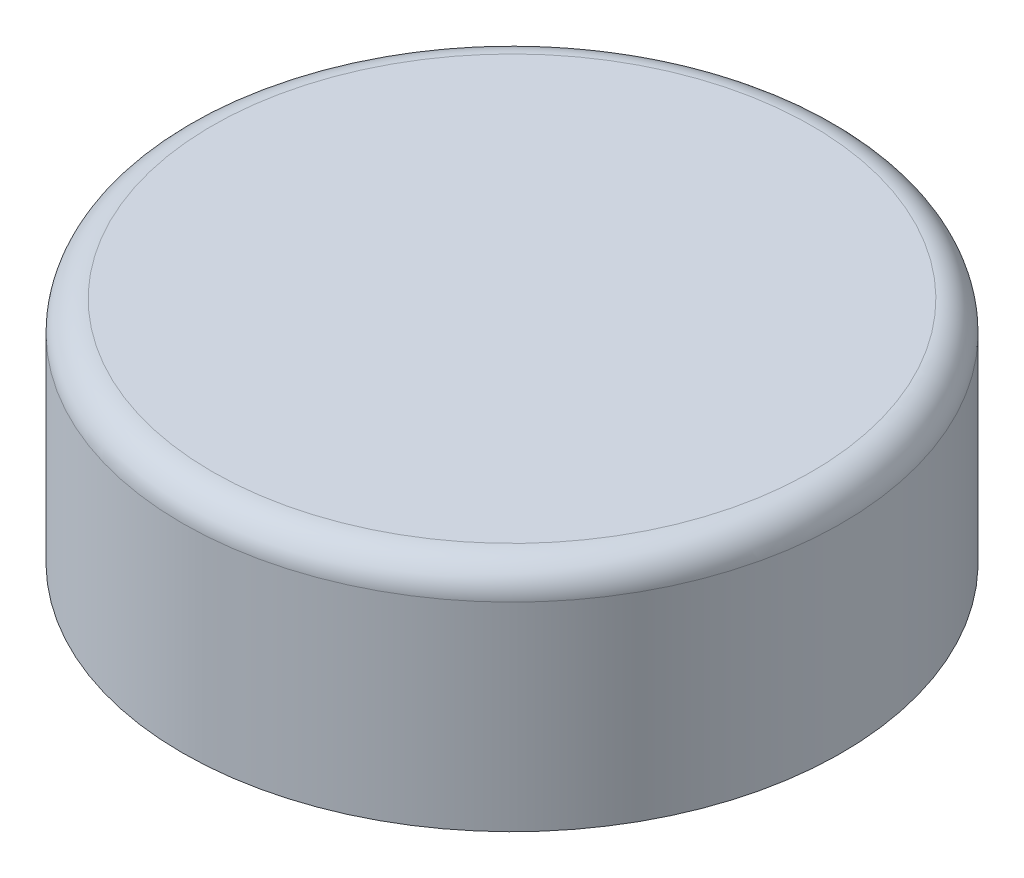
ISO-10303-21;
HEADER;
FILE_DESCRIPTION(('STEP AP214'),'2;1');
FILE_NAME('part.step','',(''),(''),'','','');
FILE_SCHEMA(('AUTOMOTIVE_DESIGN { 1 0 10303 214 1 1 1 1 }'));
ENDSEC;
DATA;
#1=APPLICATION_CONTEXT('core data for automotive mechanical design processes');
#2=APPLICATION_PROTOCOL_DEFINITION('international standard','automotive_design',2000,#1);
#3=PRODUCT_CONTEXT('',#1,'mechanical');
#4=PRODUCT('Part','Part','',(#3));
#5=PRODUCT_RELATED_PRODUCT_CATEGORY('part','',(#4));
#6=PRODUCT_DEFINITION_FORMATION('','',#4);
#7=PRODUCT_DEFINITION_CONTEXT('part definition',#1,'design');
#8=PRODUCT_DEFINITION('design','',#6,#7);
#9=PRODUCT_DEFINITION_SHAPE('','',#8);
#10=(LENGTH_UNIT() NAMED_UNIT(*) SI_UNIT(.MILLI.,.METRE.));
#11=(NAMED_UNIT(*) PLANE_ANGLE_UNIT() SI_UNIT($,.RADIAN.));
#12=(NAMED_UNIT(*) SI_UNIT($,.STERADIAN.) SOLID_ANGLE_UNIT());
#13=UNCERTAINTY_MEASURE_WITH_UNIT(LENGTH_MEASURE(1.E-05),#10,'distance_accuracy_value','');
#14=(GEOMETRIC_REPRESENTATION_CONTEXT(3) GLOBAL_UNCERTAINTY_ASSIGNED_CONTEXT((#13)) GLOBAL_UNIT_ASSIGNED_CONTEXT((#10,
#11,#12)) REPRESENTATION_CONTEXT('',''));
#15=CARTESIAN_POINT('',(0.,0.,0.));
#16=DIRECTION('',(0.,0.,1.));
#17=DIRECTION('',(1.,0.,0.));
#18=AXIS2_PLACEMENT_3D('',#15,#16,#17);
#19=CARTESIAN_POINT('',(0.,23.,0.));
#20=DIRECTION('',(0.,-1.,0.));
#21=DIRECTION('',(0.,0.,-1.));
#22=AXIS2_PLACEMENT_3D('',#19,#20,#21);
#23=CYLINDRICAL_SURFACE('',#22,30.15);
#24=DIRECTION('',(0.,-1.,0.));
#25=VECTOR('',#24,1.);
#26=CARTESIAN_POINT('',(-5.5,31.5451874952938,-29.6440972201887));
#27=LINE('',#26,#25);
#28=CARTESIAN_POINT('',(-5.5,10.,-29.6440972201887));
#29=VERTEX_POINT('',#28);
#30=CARTESIAN_POINT('',(-5.5,0.,-29.6440972201887));
#31=VERTEX_POINT('',#30);
#32=EDGE_CURVE('E151',#29,#31,#27,.T.);
#33=ORIENTED_EDGE('',*,*,#32,.F.);
#34=CARTESIAN_POINT('',(0.,10.,0.));
#35=DIRECTION('',(0.,-1.,0.));
#36=DIRECTION('',(0.,0.,-1.));
#37=AXIS2_PLACEMENT_3D('',#34,#35,#36);
#38=CIRCLE('',#37,30.15);
#39=CARTESIAN_POINT('',(5.5,10.,-29.6440972201887));
#40=VERTEX_POINT('',#39);
#41=EDGE_CURVE('E165',#40,#29,#38,.T.);
#42=ORIENTED_EDGE('',*,*,#41,.F.);
#43=DIRECTION('',(0.,-1.,0.));
#44=VECTOR('',#43,1.);
#45=CARTESIAN_POINT('',(5.5,31.5451874952938,-29.6440972201887));
#46=LINE('',#45,#44);
#47=CARTESIAN_POINT('',(5.5,0.,-29.6440972201887));
#48=VERTEX_POINT('',#47);
#49=EDGE_CURVE('E144',#40,#48,#46,.T.);
#50=ORIENTED_EDGE('',*,*,#49,.T.);
#51=CARTESIAN_POINT('',(0.,0.,0.));
#52=DIRECTION('',(0.,1.,0.));
#53=DIRECTION('',(0.,0.,1.));
#54=AXIS2_PLACEMENT_3D('',#51,#52,#53);
#55=CIRCLE('',#54,30.15);
#56=EDGE_CURVE('E225',#31,#48,#55,.T.);
#57=ORIENTED_EDGE('',*,*,#56,.F.);
#58=EDGE_LOOP('',(#33,#42,#50,#57));
#59=FACE_BOUND('',#58,.T.);
#60=ADVANCED_FACE('F41',(#59),#23,.F.);
#61=CARTESIAN_POINT('',(0.,20.,0.));
#62=DIRECTION('',(0.,1.,0.));
#63=DIRECTION('',(0.,0.,1.));
#64=AXIS2_PLACEMENT_3D('',#61,#62,#63);
#65=PLANE('',#64);
#66=DIRECTION('',(0.,0.,-1.));
#67=VECTOR('',#66,1.);
#68=CARTESIAN_POINT('',(5.5,20.,0.));
#69=LINE('',#68,#67);
#70=CARTESIAN_POINT('',(5.5,20.,-10.25));
#71=VERTEX_POINT('',#70);
#72=CARTESIAN_POINT('',(5.49999999999999,20.,-32.6905567404411));
#73=VERTEX_POINT('',#72);
#74=EDGE_CURVE('E57',#71,#73,#69,.T.);
#75=ORIENTED_EDGE('',*,*,#74,.F.);
#76=DIRECTION('',(1.,0.,0.));
#77=VECTOR('',#76,1.);
#78=CARTESIAN_POINT('',(0.,20.,-10.25));
#79=LINE('',#78,#77);
#80=CARTESIAN_POINT('',(22.75,20.,-10.25));
#81=VERTEX_POINT('',#80);
#82=EDGE_CURVE('E155',#71,#81,#79,.T.);
#83=ORIENTED_EDGE('',*,*,#82,.T.);
#84=DIRECTION('',(0.,0.,-1.));
#85=VECTOR('',#84,1.);
#86=CARTESIAN_POINT('',(22.75,20.,0.));
#87=LINE('',#86,#85);
#88=CARTESIAN_POINT('',(22.75,20.,10.25));
#89=VERTEX_POINT('',#88);
#90=EDGE_CURVE('E161',#89,#81,#87,.T.);
#91=ORIENTED_EDGE('',*,*,#90,.F.);
#92=DIRECTION('',(1.,0.,0.));
#93=VECTOR('',#92,1.);
#94=CARTESIAN_POINT('',(0.,20.,10.25));
#95=LINE('',#94,#93);
#96=CARTESIAN_POINT('',(-22.75,20.,10.25));
#97=VERTEX_POINT('',#96);
#98=EDGE_CURVE('E197',#97,#89,#95,.T.);
#99=ORIENTED_EDGE('',*,*,#98,.F.);
#100=DIRECTION('',(0.,0.,-1.));
#101=VECTOR('',#100,1.);
#102=CARTESIAN_POINT('',(-22.75,20.,0.));
#103=LINE('',#102,#101);
#104=CARTESIAN_POINT('',(-22.75,20.,-10.25));
#105=VERTEX_POINT('',#104);
#106=EDGE_CURVE('E194',#97,#105,#103,.T.);
#107=ORIENTED_EDGE('',*,*,#106,.T.);
#108=DIRECTION('',(1.,0.,0.));
#109=VECTOR('',#108,1.);
#110=CARTESIAN_POINT('',(0.,20.,-10.25));
#111=LINE('',#110,#109);
#112=CARTESIAN_POINT('',(-5.5,20.,-10.25));
#113=VERTEX_POINT('',#112);
#114=EDGE_CURVE('E64',#105,#113,#111,.T.);
#115=ORIENTED_EDGE('',*,*,#114,.T.);
#116=DIRECTION('',(0.,0.,-1.));
#117=VECTOR('',#116,1.);
#118=CARTESIAN_POINT('',(-5.5,20.,0.));
#119=LINE('',#118,#117);
#120=CARTESIAN_POINT('',(-5.5,20.,-32.6905567404411));
#121=VERTEX_POINT('',#120);
#122=EDGE_CURVE('E128',#113,#121,#119,.T.);
#123=ORIENTED_EDGE('',*,*,#122,.T.);
#124=CARTESIAN_POINT('',(0.,20.,0.));
#125=DIRECTION('',(0.,1.,0.));
#126=DIRECTION('',(0.,0.,1.));
#127=AXIS2_PLACEMENT_3D('',#124,#125,#126);
#128=CIRCLE('',#127,33.15);
#129=EDGE_CURVE('E130',#121,#73,#128,.F.);
#130=ORIENTED_EDGE('',*,*,#129,.T.);
#131=EDGE_LOOP('',(#75,#83,#91,#99,#107,#115,#123,#130));
#132=FACE_BOUND('',#131,.T.);
#133=ADVANCED_FACE('F129',(#132),#65,.F.);
#134=CARTESIAN_POINT('',(0.,23.,0.));
#135=DIRECTION('',(0.,-1.,0.));
#136=DIRECTION('',(0.,0.,-1.));
#137=AXIS2_PLACEMENT_3D('',#134,#135,#136);
#138=CYLINDRICAL_SURFACE('',#137,33.15);
#139=DIRECTION('',(0.,-1.,0.));
#140=VECTOR('',#139,1.);
#141=CARTESIAN_POINT('',(5.49999999999999,31.5451874952938,-32.6905567404411));
#142=LINE('',#141,#140);
#143=CARTESIAN_POINT('',(5.49999999999999,0.,-32.6905567404411));
#144=VERTEX_POINT('',#143);
#145=EDGE_CURVE('E124',#73,#144,#142,.T.);
#146=ORIENTED_EDGE('',*,*,#145,.F.);
#147=CARTESIAN_POINT('',(0.,20.,0.));
#148=DIRECTION('',(0.,1.,0.));
#149=DIRECTION('',(0.,0.,1.));
#150=AXIS2_PLACEMENT_3D('',#147,#148,#149);
#151=CIRCLE('',#150,33.15);
#152=EDGE_CURVE('E11',#73,#121,#151,.F.);
#153=ORIENTED_EDGE('',*,*,#152,.T.);
#154=DIRECTION('',(0.,-1.,0.));
#155=VECTOR('',#154,1.);
#156=CARTESIAN_POINT('',(-5.5,31.5451874952938,-32.6905567404411));
#157=LINE('',#156,#155);
#158=CARTESIAN_POINT('',(-5.5,0.,-32.6905567404411));
#159=VERTEX_POINT('',#158);
#160=EDGE_CURVE('E122',#121,#159,#157,.T.);
#161=ORIENTED_EDGE('',*,*,#160,.T.);
#162=CARTESIAN_POINT('',(0.,0.,0.));
#163=DIRECTION('',(0.,1.,0.));
#164=DIRECTION('',(0.,0.,1.));
#165=AXIS2_PLACEMENT_3D('',#162,#163,#164);
#166=CIRCLE('',#165,33.15);
#167=EDGE_CURVE('E229',#159,#144,#166,.T.);
#168=ORIENTED_EDGE('',*,*,#167,.T.);
#169=EDGE_LOOP('',(#146,#153,#161,#168));
#170=FACE_BOUND('',#169,.T.);
#171=ADVANCED_FACE('F119',(#170),#138,.T.);
#172=CARTESIAN_POINT('',(0.,23.,0.));
#173=DIRECTION('',(0.,1.,0.));
#174=DIRECTION('',(0.,0.,1.));
#175=AXIS2_PLACEMENT_3D('',#172,#173,#174);
#176=PLANE('',#175);
#177=CARTESIAN_POINT('',(0.,23.,0.));
#178=DIRECTION('',(0.,1.,0.));
#179=DIRECTION('',(0.,0.,1.));
#180=AXIS2_PLACEMENT_3D('',#177,#178,#179);
#181=CIRCLE('',#180,30.15);
#182=CARTESIAN_POINT('',(0.,23.,30.15));
#183=VERTEX_POINT('',#182);
#184=EDGE_CURVE('E50',#183,#183,#181,.T.);
#185=ORIENTED_EDGE('',*,*,#184,.T.);
#186=EDGE_LOOP('',(#185));
#187=FACE_BOUND('',#186,.T.);
#188=ADVANCED_FACE('F235',(#187),#176,.T.);
#189=CARTESIAN_POINT('',(0.,0.,0.));
#190=DIRECTION('',(0.,1.,0.));
#191=DIRECTION('',(0.,0.,1.));
#192=AXIS2_PLACEMENT_3D('',#189,#190,#191);
#193=PLANE('',#192);
#194=ORIENTED_EDGE('',*,*,#167,.F.);
#195=DIRECTION('',(0.,0.,-1.));
#196=VECTOR('',#195,1.);
#197=CARTESIAN_POINT('',(-5.5,0.,-29.6440972201887));
#198=LINE('',#197,#196);
#199=EDGE_CURVE('E136',#31,#159,#198,.T.);
#200=ORIENTED_EDGE('',*,*,#199,.F.);
#201=ORIENTED_EDGE('',*,*,#56,.T.);
#202=DIRECTION('',(0.,0.,1.));
#203=VECTOR('',#202,1.);
#204=CARTESIAN_POINT('',(5.5,0.,-29.6440972201887));
#205=LINE('',#204,#203);
#206=EDGE_CURVE('E138',#144,#48,#205,.T.);
#207=ORIENTED_EDGE('',*,*,#206,.F.);
#208=EDGE_LOOP('',(#194,#200,#201,#207));
#209=FACE_BOUND('',#208,.T.);
#210=ADVANCED_FACE('F257',(#209),#193,.F.);
#211=CARTESIAN_POINT('',(0.,10.,-10.25));
#212=DIRECTION('',(0.,0.,1.));
#213=DIRECTION('',(1.,0.,0.));
#214=AXIS2_PLACEMENT_3D('',#211,#212,#213);
#215=PLANE('',#214);
#216=ORIENTED_EDGE('',*,*,#82,.F.);
#217=DIRECTION('',(0.,1.,0.));
#218=VECTOR('',#217,1.);
#219=CARTESIAN_POINT('',(5.5,10.,-10.25));
#220=LINE('',#219,#218);
#221=CARTESIAN_POINT('',(5.5,10.,-10.25));
#222=VERTEX_POINT('',#221);
#223=EDGE_CURVE('E222',#222,#71,#220,.T.);
#224=ORIENTED_EDGE('',*,*,#223,.F.);
#225=DIRECTION('',(1.,0.,0.));
#226=VECTOR('',#225,1.);
#227=CARTESIAN_POINT('',(0.,10.,-10.25));
#228=LINE('',#227,#226);
#229=CARTESIAN_POINT('',(22.75,10.,-10.25));
#230=VERTEX_POINT('',#229);
#231=EDGE_CURVE('E156',#222,#230,#228,.T.);
#232=ORIENTED_EDGE('',*,*,#231,.T.);
#233=DIRECTION('',(0.,1.,0.));
#234=VECTOR('',#233,1.);
#235=CARTESIAN_POINT('',(22.75,10.,-10.25));
#236=LINE('',#235,#234);
#237=EDGE_CURVE('E187',#230,#81,#236,.T.);
#238=ORIENTED_EDGE('',*,*,#237,.T.);
#239=EDGE_LOOP('',(#216,#224,#232,#238));
#240=FACE_BOUND('',#239,.T.);
#241=ADVANCED_FACE('F252',(#240),#215,.T.);
#242=CARTESIAN_POINT('',(5.5,10.,0.));
#243=DIRECTION('',(1.,0.,0.));
#244=DIRECTION('',(0.,0.,-1.));
#245=AXIS2_PLACEMENT_3D('',#242,#243,#244);
#246=PLANE('',#245);
#247=ORIENTED_EDGE('',*,*,#74,.T.);
#248=ORIENTED_EDGE('',*,*,#145,.T.);
#249=ORIENTED_EDGE('',*,*,#206,.T.);
#250=ORIENTED_EDGE('',*,*,#49,.F.);
#251=DIRECTION('',(0.,0.,-1.));
#252=VECTOR('',#251,1.);
#253=CARTESIAN_POINT('',(5.5,10.,0.));
#254=LINE('',#253,#252);
#255=EDGE_CURVE('E160',#222,#40,#254,.T.);
#256=ORIENTED_EDGE('',*,*,#255,.F.);
#257=ORIENTED_EDGE('',*,*,#223,.T.);
#258=EDGE_LOOP('',(#247,#248,#249,#250,#256,#257));
#259=FACE_BOUND('',#258,.T.);
#260=ADVANCED_FACE('F281',(#259),#246,.F.);
#261=CARTESIAN_POINT('',(-5.5,10.,0.));
#262=DIRECTION('',(1.,0.,0.));
#263=DIRECTION('',(0.,0.,-1.));
#264=AXIS2_PLACEMENT_3D('',#261,#262,#263);
#265=PLANE('',#264);
#266=ORIENTED_EDGE('',*,*,#122,.F.);
#267=DIRECTION('',(0.,1.,0.));
#268=VECTOR('',#267,1.);
#269=CARTESIAN_POINT('',(-5.5,10.,-10.25));
#270=LINE('',#269,#268);
#271=CARTESIAN_POINT('',(-5.5,10.,-10.25));
#272=VERTEX_POINT('',#271);
#273=EDGE_CURVE('E219',#272,#113,#270,.T.);
#274=ORIENTED_EDGE('',*,*,#273,.F.);
#275=DIRECTION('',(0.,0.,-1.));
#276=VECTOR('',#275,1.);
#277=CARTESIAN_POINT('',(-5.5,10.,0.));
#278=LINE('',#277,#276);
#279=EDGE_CURVE('E169',#272,#29,#278,.T.);
#280=ORIENTED_EDGE('',*,*,#279,.T.);
#281=ORIENTED_EDGE('',*,*,#32,.T.);
#282=ORIENTED_EDGE('',*,*,#199,.T.);
#283=ORIENTED_EDGE('',*,*,#160,.F.);
#284=EDGE_LOOP('',(#266,#274,#280,#281,#282,#283));
#285=FACE_BOUND('',#284,.T.);
#286=ADVANCED_FACE('F134',(#285),#265,.T.);
#287=CARTESIAN_POINT('',(0.,10.,-10.25));
#288=DIRECTION('',(0.,0.,1.));
#289=DIRECTION('',(1.,0.,0.));
#290=AXIS2_PLACEMENT_3D('',#287,#288,#289);
#291=PLANE('',#290);
#292=ORIENTED_EDGE('',*,*,#114,.F.);
#293=DIRECTION('',(0.,1.,0.));
#294=VECTOR('',#293,1.);
#295=CARTESIAN_POINT('',(-22.75,10.,-10.25));
#296=LINE('',#295,#294);
#297=CARTESIAN_POINT('',(-22.75,10.,-10.25));
#298=VERTEX_POINT('',#297);
#299=EDGE_CURVE('E215',#298,#105,#296,.T.);
#300=ORIENTED_EDGE('',*,*,#299,.F.);
#301=DIRECTION('',(1.,0.,0.));
#302=VECTOR('',#301,1.);
#303=CARTESIAN_POINT('',(0.,10.,-10.25));
#304=LINE('',#303,#302);
#305=EDGE_CURVE('E173',#298,#272,#304,.T.);
#306=ORIENTED_EDGE('',*,*,#305,.T.);
#307=ORIENTED_EDGE('',*,*,#273,.T.);
#308=EDGE_LOOP('',(#292,#300,#306,#307));
#309=FACE_BOUND('',#308,.T.);
#310=ADVANCED_FACE('F294',(#309),#291,.T.);
#311=CARTESIAN_POINT('',(-22.75,10.,0.));
#312=DIRECTION('',(1.,0.,0.));
#313=DIRECTION('',(0.,0.,-1.));
#314=AXIS2_PLACEMENT_3D('',#311,#312,#313);
#315=PLANE('',#314);
#316=ORIENTED_EDGE('',*,*,#106,.F.);
#317=DIRECTION('',(0.,1.,0.));
#318=VECTOR('',#317,1.);
#319=CARTESIAN_POINT('',(-22.75,10.,10.25));
#320=LINE('',#319,#318);
#321=CARTESIAN_POINT('',(-22.75,10.,10.25));
#322=VERTEX_POINT('',#321);
#323=EDGE_CURVE('E211',#322,#97,#320,.T.);
#324=ORIENTED_EDGE('',*,*,#323,.F.);
#325=DIRECTION('',(0.,0.,-1.));
#326=VECTOR('',#325,1.);
#327=CARTESIAN_POINT('',(-22.75,10.,0.));
#328=LINE('',#327,#326);
#329=EDGE_CURVE('E177',#322,#298,#328,.T.);
#330=ORIENTED_EDGE('',*,*,#329,.T.);
#331=ORIENTED_EDGE('',*,*,#299,.T.);
#332=EDGE_LOOP('',(#316,#324,#330,#331));
#333=FACE_BOUND('',#332,.T.);
#334=ADVANCED_FACE('F300',(#333),#315,.T.);
#335=CARTESIAN_POINT('',(0.,10.,10.25));
#336=DIRECTION('',(0.,0.,1.));
#337=DIRECTION('',(1.,0.,0.));
#338=AXIS2_PLACEMENT_3D('',#335,#336,#337);
#339=PLANE('',#338);
#340=ORIENTED_EDGE('',*,*,#98,.T.);
#341=DIRECTION('',(0.,1.,0.));
#342=VECTOR('',#341,1.);
#343=CARTESIAN_POINT('',(22.75,10.,10.25));
#344=LINE('',#343,#342);
#345=CARTESIAN_POINT('',(22.75,10.,10.25));
#346=VERTEX_POINT('',#345);
#347=EDGE_CURVE('E207',#346,#89,#344,.T.);
#348=ORIENTED_EDGE('',*,*,#347,.F.);
#349=DIRECTION('',(1.,0.,0.));
#350=VECTOR('',#349,1.);
#351=CARTESIAN_POINT('',(0.,10.,10.25));
#352=LINE('',#351,#350);
#353=EDGE_CURVE('E181',#322,#346,#352,.T.);
#354=ORIENTED_EDGE('',*,*,#353,.F.);
#355=ORIENTED_EDGE('',*,*,#323,.T.);
#356=EDGE_LOOP('',(#340,#348,#354,#355));
#357=FACE_BOUND('',#356,.T.);
#358=ADVANCED_FACE('F308',(#357),#339,.F.);
#359=CARTESIAN_POINT('',(22.75,10.,0.));
#360=DIRECTION('',(1.,0.,0.));
#361=DIRECTION('',(0.,0.,-1.));
#362=AXIS2_PLACEMENT_3D('',#359,#360,#361);
#363=PLANE('',#362);
#364=ORIENTED_EDGE('',*,*,#90,.T.);
#365=ORIENTED_EDGE('',*,*,#237,.F.);
#366=DIRECTION('',(0.,0.,-1.));
#367=VECTOR('',#366,1.);
#368=CARTESIAN_POINT('',(22.75,10.,0.));
#369=LINE('',#368,#367);
#370=EDGE_CURVE('E184',#346,#230,#369,.T.);
#371=ORIENTED_EDGE('',*,*,#370,.F.);
#372=ORIENTED_EDGE('',*,*,#347,.T.);
#373=EDGE_LOOP('',(#364,#365,#371,#372));
#374=FACE_BOUND('',#373,.T.);
#375=ADVANCED_FACE('F241',(#374),#363,.F.);
#376=CARTESIAN_POINT('',(0.,10.,0.));
#377=DIRECTION('',(0.,-1.,0.));
#378=DIRECTION('',(0.,0.,-1.));
#379=AXIS2_PLACEMENT_3D('',#376,#377,#378);
#380=PLANE('',#379);
#381=ORIENTED_EDGE('',*,*,#231,.F.);
#382=ORIENTED_EDGE('',*,*,#255,.T.);
#383=ORIENTED_EDGE('',*,*,#41,.T.);
#384=ORIENTED_EDGE('',*,*,#279,.F.);
#385=ORIENTED_EDGE('',*,*,#305,.F.);
#386=ORIENTED_EDGE('',*,*,#329,.F.);
#387=ORIENTED_EDGE('',*,*,#353,.T.);
#388=ORIENTED_EDGE('',*,*,#370,.T.);
#389=EDGE_LOOP('',(#381,#382,#383,#384,#385,#386,#387,#388));
#390=FACE_BOUND('',#389,.T.);
#391=ADVANCED_FACE('F237',(#390),#380,.T.);
#392=CARTESIAN_POINT('',(0.,20.,0.));
#393=DIRECTION('',(0.,1.,0.));
#394=DIRECTION('',(0.,0.,1.));
#395=AXIS2_PLACEMENT_3D('',#392,#393,#394);
#396=TOROIDAL_SURFACE('',#395,30.15,3.);
#397=ORIENTED_EDGE('',*,*,#152,.F.);
#398=ORIENTED_EDGE('',*,*,#129,.F.);
#399=EDGE_LOOP('',(#397,#398));
#400=FACE_BOUND('',#399,.T.);
#401=ORIENTED_EDGE('',*,*,#184,.F.);
#402=EDGE_LOOP('',(#401));
#403=FACE_BOUND('',#402,.T.);
#404=ADVANCED_FACE('F43',(#400,#403),#396,.T.);
#405=CLOSED_SHELL('',(#60,#133,#171,#188,#210,#241,#260,#286,#310,#334,#358,#375,#391,#404));
#406=MANIFOLD_SOLID_BREP('B2',#405);
#407=ADVANCED_BREP_SHAPE_REPRESENTATION('',(#18,#406),#14);
#408=SHAPE_DEFINITION_REPRESENTATION(#9,#407);
ENDSEC;
END-ISO-10303-21;
